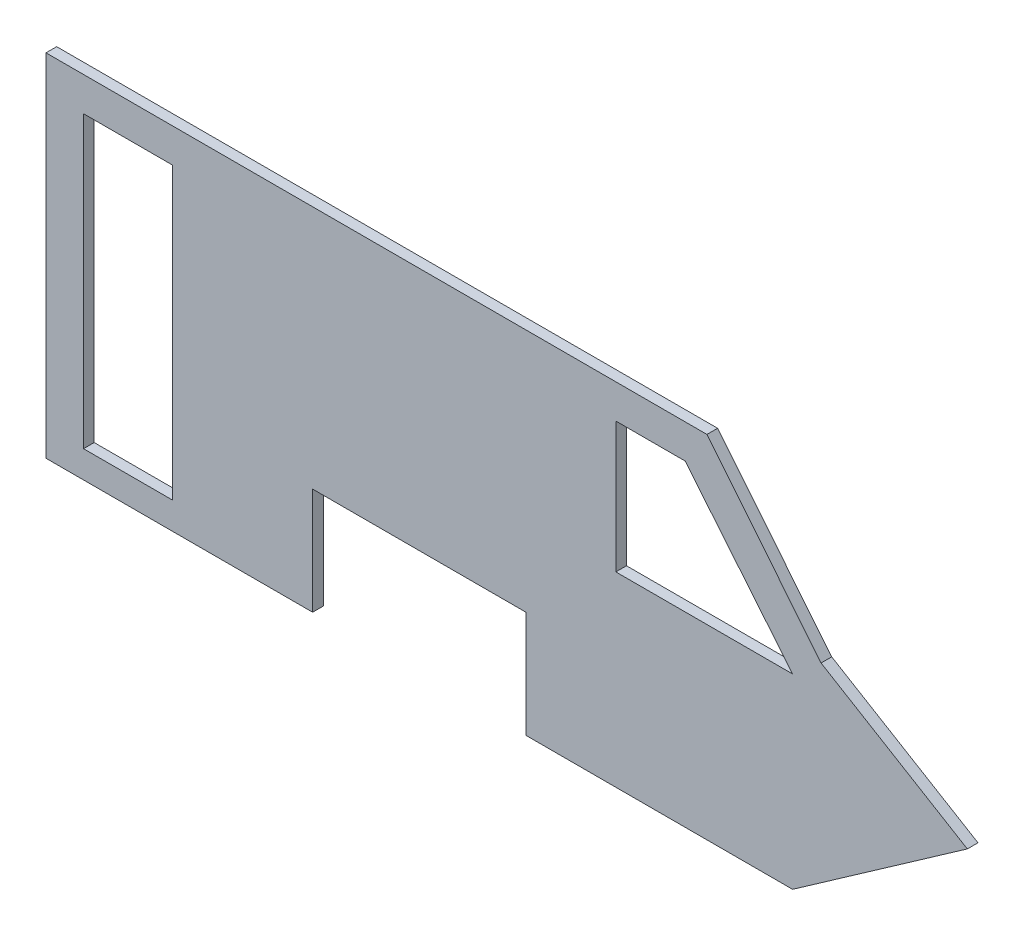
ISO-10303-21;
HEADER;
FILE_DESCRIPTION(('STEP AP214'),'2;1');
FILE_NAME('part.step','',(''),(''),'','','');
FILE_SCHEMA(('AUTOMOTIVE_DESIGN { 1 0 10303 214 1 1 1 1 }'));
ENDSEC;
DATA;
#1=APPLICATION_CONTEXT('core data for automotive mechanical design processes');
#2=APPLICATION_PROTOCOL_DEFINITION('international standard','automotive_design',2000,#1);
#3=PRODUCT_CONTEXT('',#1,'mechanical');
#4=PRODUCT('Part','Part','',(#3));
#5=PRODUCT_RELATED_PRODUCT_CATEGORY('part','',(#4));
#6=PRODUCT_DEFINITION_FORMATION('','',#4);
#7=PRODUCT_DEFINITION_CONTEXT('part definition',#1,'design');
#8=PRODUCT_DEFINITION('design','',#6,#7);
#9=PRODUCT_DEFINITION_SHAPE('','',#8);
#10=(LENGTH_UNIT() NAMED_UNIT(*) SI_UNIT(.MILLI.,.METRE.));
#11=(NAMED_UNIT(*) PLANE_ANGLE_UNIT() SI_UNIT($,.RADIAN.));
#12=(NAMED_UNIT(*) SI_UNIT($,.STERADIAN.) SOLID_ANGLE_UNIT());
#13=UNCERTAINTY_MEASURE_WITH_UNIT(LENGTH_MEASURE(1.E-05),#10,'distance_accuracy_value','');
#14=(GEOMETRIC_REPRESENTATION_CONTEXT(3) GLOBAL_UNCERTAINTY_ASSIGNED_CONTEXT((#13)) GLOBAL_UNIT_ASSIGNED_CONTEXT((#10,
#11,#12)) REPRESENTATION_CONTEXT('',''));
#15=CARTESIAN_POINT('',(0.,0.,0.));
#16=DIRECTION('',(0.,0.,1.));
#17=DIRECTION('',(1.,0.,0.));
#18=AXIS2_PLACEMENT_3D('',#15,#16,#17);
#19=CARTESIAN_POINT('',(0.,65.8472385407004,-2.));
#20=DIRECTION('',(-1.,0.,0.));
#21=DIRECTION('',(0.,-1.,0.));
#22=AXIS2_PLACEMENT_3D('',#19,#20,#21);
#23=PLANE('',#22);
#24=DIRECTION('',(0.,-1.,0.));
#25=VECTOR('',#24,1.);
#26=CARTESIAN_POINT('',(0.,65.8472385407004,0.));
#27=LINE('',#26,#25);
#28=CARTESIAN_POINT('',(0.,65.8472385407004,0.));
#29=VERTEX_POINT('',#28);
#30=CARTESIAN_POINT('',(0.,0.,0.));
#31=VERTEX_POINT('',#30);
#32=EDGE_CURVE('E222',#29,#31,#27,.T.);
#33=ORIENTED_EDGE('',*,*,#32,.F.);
#34=DIRECTION('',(0.,0.,1.));
#35=VECTOR('',#34,1.);
#36=CARTESIAN_POINT('',(0.,65.8472385407004,-2.));
#37=LINE('',#36,#35);
#38=CARTESIAN_POINT('',(0.,65.8472385407004,-2.));
#39=VERTEX_POINT('',#38);
#40=EDGE_CURVE('E11',#39,#29,#37,.T.);
#41=ORIENTED_EDGE('',*,*,#40,.F.);
#42=DIRECTION('',(0.,-1.,0.));
#43=VECTOR('',#42,1.);
#44=CARTESIAN_POINT('',(0.,65.8472385407004,-2.));
#45=LINE('',#44,#43);
#46=CARTESIAN_POINT('',(0.,0.,-2.));
#47=VERTEX_POINT('',#46);
#48=EDGE_CURVE('E229',#39,#47,#45,.T.);
#49=ORIENTED_EDGE('',*,*,#48,.T.);
#50=DIRECTION('',(0.,0.,1.));
#51=VECTOR('',#50,1.);
#52=CARTESIAN_POINT('',(0.,0.,-2.));
#53=LINE('',#52,#51);
#54=EDGE_CURVE('E38',#47,#31,#53,.T.);
#55=ORIENTED_EDGE('',*,*,#54,.T.);
#56=EDGE_LOOP('',(#33,#41,#49,#55));
#57=FACE_BOUND('',#56,.T.);
#58=ADVANCED_FACE('F35',(#57),#23,.T.);
#59=CARTESIAN_POINT('',(123.939834853397,65.8472385407004,-2.));
#60=DIRECTION('',(0.,1.,0.));
#61=DIRECTION('',(0.,0.,1.));
#62=AXIS2_PLACEMENT_3D('',#59,#60,#61);
#63=PLANE('',#62);
#64=DIRECTION('',(-1.,0.,0.));
#65=VECTOR('',#64,1.);
#66=CARTESIAN_POINT('',(123.939834853397,65.8472385407004,0.));
#67=LINE('',#66,#65);
#68=CARTESIAN_POINT('',(123.939834853397,65.8472385407004,0.));
#69=VERTEX_POINT('',#68);
#70=EDGE_CURVE('E233',#69,#29,#67,.T.);
#71=ORIENTED_EDGE('',*,*,#70,.F.);
#72=DIRECTION('',(0.,0.,1.));
#73=VECTOR('',#72,1.);
#74=CARTESIAN_POINT('',(123.939834853397,65.8472385407004,-2.));
#75=LINE('',#74,#73);
#76=CARTESIAN_POINT('',(123.939834853397,65.8472385407004,-2.));
#77=VERTEX_POINT('',#76);
#78=EDGE_CURVE('E43',#77,#69,#75,.T.);
#79=ORIENTED_EDGE('',*,*,#78,.F.);
#80=DIRECTION('',(-1.,0.,0.));
#81=VECTOR('',#80,1.);
#82=CARTESIAN_POINT('',(123.939834853397,65.8472385407004,-2.));
#83=LINE('',#82,#81);
#84=EDGE_CURVE('E257',#77,#39,#83,.T.);
#85=ORIENTED_EDGE('',*,*,#84,.T.);
#86=ORIENTED_EDGE('',*,*,#40,.T.);
#87=EDGE_LOOP('',(#71,#79,#85,#86));
#88=FACE_BOUND('',#87,.T.);
#89=ADVANCED_FACE('F314',(#88),#63,.T.);
#90=CARTESIAN_POINT('',(145.336728149092,39.4242758511635,-2.));
#91=DIRECTION('',(0.777145961456968,0.629320391049841,0.));
#92=DIRECTION('',(-0.629320391049841,0.777145961456968,0.));
#93=AXIS2_PLACEMENT_3D('',#90,#91,#92);
#94=PLANE('',#93);
#95=DIRECTION('',(-0.629320391049841,0.777145961456968,0.));
#96=VECTOR('',#95,1.);
#97=CARTESIAN_POINT('',(145.336728149092,39.4242758511635,0.));
#98=LINE('',#97,#96);
#99=CARTESIAN_POINT('',(145.336728149092,39.4242758511635,0.));
#100=VERTEX_POINT('',#99);
#101=EDGE_CURVE('E283',#100,#69,#98,.T.);
#102=ORIENTED_EDGE('',*,*,#101,.F.);
#103=DIRECTION('',(0.,0.,1.));
#104=VECTOR('',#103,1.);
#105=CARTESIAN_POINT('',(145.336728149092,39.4242758511635,-2.));
#106=LINE('',#105,#104);
#107=CARTESIAN_POINT('',(145.336728149092,39.4242758511635,-2.));
#108=VERTEX_POINT('',#107);
#109=EDGE_CURVE('E289',#108,#100,#106,.T.);
#110=ORIENTED_EDGE('',*,*,#109,.F.);
#111=DIRECTION('',(-0.629320391049841,0.777145961456968,0.));
#112=VECTOR('',#111,1.);
#113=CARTESIAN_POINT('',(145.336728149092,39.4242758511635,-2.));
#114=LINE('',#113,#112);
#115=EDGE_CURVE('E254',#108,#77,#114,.T.);
#116=ORIENTED_EDGE('',*,*,#115,.T.);
#117=ORIENTED_EDGE('',*,*,#78,.T.);
#118=EDGE_LOOP('',(#102,#110,#116,#117));
#119=FACE_BOUND('',#118,.T.);
#120=ADVANCED_FACE('F342',(#119),#94,.T.);
#121=CARTESIAN_POINT('',(172.76608177156,22.9430574540419,-2.));
#122=DIRECTION('',(0.515038074910049,0.857167300702115,0.));
#123=DIRECTION('',(-0.857167300702115,0.515038074910049,0.));
#124=AXIS2_PLACEMENT_3D('',#121,#122,#123);
#125=PLANE('',#124);
#126=DIRECTION('',(-0.857167300702116,0.515038074910049,0.));
#127=VECTOR('',#126,1.);
#128=CARTESIAN_POINT('',(172.76608177156,22.9430574540419,0.));
#129=LINE('',#128,#127);
#130=CARTESIAN_POINT('',(172.76608177156,22.9430574540419,0.));
#131=VERTEX_POINT('',#130);
#132=EDGE_CURVE('E280',#131,#100,#129,.T.);
#133=ORIENTED_EDGE('',*,*,#132,.F.);
#134=DIRECTION('',(0.,0.,1.));
#135=VECTOR('',#134,1.);
#136=CARTESIAN_POINT('',(172.76608177156,22.9430574540419,-2.));
#137=LINE('',#136,#135);
#138=CARTESIAN_POINT('',(172.76608177156,22.9430574540419,-2.));
#139=VERTEX_POINT('',#138);
#140=EDGE_CURVE('E291',#139,#131,#137,.T.);
#141=ORIENTED_EDGE('',*,*,#140,.F.);
#142=DIRECTION('',(-0.857167300702116,0.515038074910049,0.));
#143=VECTOR('',#142,1.);
#144=CARTESIAN_POINT('',(172.76608177156,22.9430574540419,-2.));
#145=LINE('',#144,#143);
#146=EDGE_CURVE('E251',#139,#108,#145,.T.);
#147=ORIENTED_EDGE('',*,*,#146,.T.);
#148=ORIENTED_EDGE('',*,*,#109,.T.);
#149=EDGE_LOOP('',(#133,#141,#147,#148));
#150=FACE_BOUND('',#149,.T.);
#151=ADVANCED_FACE('F340',(#150),#125,.T.);
#152=CARTESIAN_POINT('',(140.,0.,-2.));
#153=DIRECTION('',(0.573576436351047,-0.819152044288991,0.));
#154=DIRECTION('',(0.819152044288991,0.573576436351047,0.));
#155=AXIS2_PLACEMENT_3D('',#152,#153,#154);
#156=PLANE('',#155);
#157=DIRECTION('',(0.819152044288991,0.573576436351047,0.));
#158=VECTOR('',#157,1.);
#159=CARTESIAN_POINT('',(140.,0.,0.));
#160=LINE('',#159,#158);
#161=CARTESIAN_POINT('',(140.,0.,0.));
#162=VERTEX_POINT('',#161);
#163=EDGE_CURVE('E277',#162,#131,#160,.T.);
#164=ORIENTED_EDGE('',*,*,#163,.F.);
#165=DIRECTION('',(0.,0.,1.));
#166=VECTOR('',#165,1.);
#167=CARTESIAN_POINT('',(140.,0.,-2.));
#168=LINE('',#167,#166);
#169=CARTESIAN_POINT('',(140.,0.,-2.));
#170=VERTEX_POINT('',#169);
#171=EDGE_CURVE('E293',#170,#162,#168,.T.);
#172=ORIENTED_EDGE('',*,*,#171,.F.);
#173=DIRECTION('',(0.819152044288991,0.573576436351047,0.));
#174=VECTOR('',#173,1.);
#175=CARTESIAN_POINT('',(140.,0.,-2.));
#176=LINE('',#175,#174);
#177=EDGE_CURVE('E248',#170,#139,#176,.T.);
#178=ORIENTED_EDGE('',*,*,#177,.T.);
#179=ORIENTED_EDGE('',*,*,#140,.T.);
#180=EDGE_LOOP('',(#164,#172,#178,#179));
#181=FACE_BOUND('',#180,.T.);
#182=ADVANCED_FACE('F336',(#181),#156,.T.);
#183=CARTESIAN_POINT('',(90.,0.,-2.));
#184=DIRECTION('',(0.,-1.,0.));
#185=DIRECTION('',(0.,0.,-1.));
#186=AXIS2_PLACEMENT_3D('',#183,#184,#185);
#187=PLANE('',#186);
#188=DIRECTION('',(1.,0.,0.));
#189=VECTOR('',#188,1.);
#190=CARTESIAN_POINT('',(90.,0.,0.));
#191=LINE('',#190,#189);
#192=CARTESIAN_POINT('',(90.,0.,0.));
#193=VERTEX_POINT('',#192);
#194=EDGE_CURVE('E274',#193,#162,#191,.T.);
#195=ORIENTED_EDGE('',*,*,#194,.F.);
#196=DIRECTION('',(0.,0.,1.));
#197=VECTOR('',#196,1.);
#198=CARTESIAN_POINT('',(90.,0.,-2.));
#199=LINE('',#198,#197);
#200=CARTESIAN_POINT('',(90.,0.,-2.));
#201=VERTEX_POINT('',#200);
#202=EDGE_CURVE('E295',#201,#193,#199,.T.);
#203=ORIENTED_EDGE('',*,*,#202,.F.);
#204=DIRECTION('',(1.,0.,0.));
#205=VECTOR('',#204,1.);
#206=CARTESIAN_POINT('',(90.,0.,-2.));
#207=LINE('',#206,#205);
#208=EDGE_CURVE('E245',#201,#170,#207,.T.);
#209=ORIENTED_EDGE('',*,*,#208,.T.);
#210=ORIENTED_EDGE('',*,*,#171,.T.);
#211=EDGE_LOOP('',(#195,#203,#209,#210));
#212=FACE_BOUND('',#211,.T.);
#213=ADVANCED_FACE('F332',(#212),#187,.T.);
#214=CARTESIAN_POINT('',(90.,20.,-2.));
#215=DIRECTION('',(-1.,0.,0.));
#216=DIRECTION('',(0.,0.,1.));
#217=AXIS2_PLACEMENT_3D('',#214,#215,#216);
#218=PLANE('',#217);
#219=DIRECTION('',(0.,-1.,0.));
#220=VECTOR('',#219,1.);
#221=CARTESIAN_POINT('',(90.,20.,0.));
#222=LINE('',#221,#220);
#223=CARTESIAN_POINT('',(90.,20.,0.));
#224=VERTEX_POINT('',#223);
#225=EDGE_CURVE('E271',#224,#193,#222,.T.);
#226=ORIENTED_EDGE('',*,*,#225,.F.);
#227=DIRECTION('',(0.,0.,1.));
#228=VECTOR('',#227,1.);
#229=CARTESIAN_POINT('',(90.,20.,-2.));
#230=LINE('',#229,#228);
#231=CARTESIAN_POINT('',(90.,20.,-2.));
#232=VERTEX_POINT('',#231);
#233=EDGE_CURVE('E297',#232,#224,#230,.T.);
#234=ORIENTED_EDGE('',*,*,#233,.F.);
#235=DIRECTION('',(0.,-1.,0.));
#236=VECTOR('',#235,1.);
#237=CARTESIAN_POINT('',(90.,20.,-2.));
#238=LINE('',#237,#236);
#239=EDGE_CURVE('E242',#232,#201,#238,.T.);
#240=ORIENTED_EDGE('',*,*,#239,.T.);
#241=ORIENTED_EDGE('',*,*,#202,.T.);
#242=EDGE_LOOP('',(#226,#234,#240,#241));
#243=FACE_BOUND('',#242,.T.);
#244=ADVANCED_FACE('F328',(#243),#218,.T.);
#245=CARTESIAN_POINT('',(50.,20.,-2.));
#246=DIRECTION('',(0.,-1.,0.));
#247=DIRECTION('',(0.,0.,-1.));
#248=AXIS2_PLACEMENT_3D('',#245,#246,#247);
#249=PLANE('',#248);
#250=DIRECTION('',(1.,0.,0.));
#251=VECTOR('',#250,1.);
#252=CARTESIAN_POINT('',(50.,20.,0.));
#253=LINE('',#252,#251);
#254=CARTESIAN_POINT('',(50.,20.,0.));
#255=VERTEX_POINT('',#254);
#256=EDGE_CURVE('E268',#255,#224,#253,.T.);
#257=ORIENTED_EDGE('',*,*,#256,.F.);
#258=DIRECTION('',(0.,0.,1.));
#259=VECTOR('',#258,1.);
#260=CARTESIAN_POINT('',(50.,20.,-2.));
#261=LINE('',#260,#259);
#262=CARTESIAN_POINT('',(50.,20.,-2.));
#263=VERTEX_POINT('',#262);
#264=EDGE_CURVE('E299',#263,#255,#261,.T.);
#265=ORIENTED_EDGE('',*,*,#264,.F.);
#266=DIRECTION('',(1.,0.,0.));
#267=VECTOR('',#266,1.);
#268=CARTESIAN_POINT('',(50.,20.,-2.));
#269=LINE('',#268,#267);
#270=EDGE_CURVE('E239',#263,#232,#269,.T.);
#271=ORIENTED_EDGE('',*,*,#270,.T.);
#272=ORIENTED_EDGE('',*,*,#233,.T.);
#273=EDGE_LOOP('',(#257,#265,#271,#272));
#274=FACE_BOUND('',#273,.T.);
#275=ADVANCED_FACE('F326',(#274),#249,.T.);
#276=CARTESIAN_POINT('',(50.,0.,-2.));
#277=DIRECTION('',(1.,0.,0.));
#278=DIRECTION('',(0.,0.,-1.));
#279=AXIS2_PLACEMENT_3D('',#276,#277,#278);
#280=PLANE('',#279);
#281=DIRECTION('',(0.,1.,0.));
#282=VECTOR('',#281,1.);
#283=CARTESIAN_POINT('',(50.,0.,0.));
#284=LINE('',#283,#282);
#285=CARTESIAN_POINT('',(50.,0.,0.));
#286=VERTEX_POINT('',#285);
#287=EDGE_CURVE('E265',#286,#255,#284,.T.);
#288=ORIENTED_EDGE('',*,*,#287,.F.);
#289=DIRECTION('',(0.,0.,1.));
#290=VECTOR('',#289,1.);
#291=CARTESIAN_POINT('',(50.,0.,-2.));
#292=LINE('',#291,#290);
#293=CARTESIAN_POINT('',(50.,0.,-2.));
#294=VERTEX_POINT('',#293);
#295=EDGE_CURVE('E300',#294,#286,#292,.T.);
#296=ORIENTED_EDGE('',*,*,#295,.F.);
#297=DIRECTION('',(0.,1.,0.));
#298=VECTOR('',#297,1.);
#299=CARTESIAN_POINT('',(50.,0.,-2.));
#300=LINE('',#299,#298);
#301=EDGE_CURVE('E236',#294,#263,#300,.T.);
#302=ORIENTED_EDGE('',*,*,#301,.T.);
#303=ORIENTED_EDGE('',*,*,#264,.T.);
#304=EDGE_LOOP('',(#288,#296,#302,#303));
#305=FACE_BOUND('',#304,.T.);
#306=ADVANCED_FACE('F322',(#305),#280,.T.);
#307=CARTESIAN_POINT('',(0.,0.,-2.));
#308=DIRECTION('',(0.,-1.,0.));
#309=DIRECTION('',(0.,0.,-1.));
#310=AXIS2_PLACEMENT_3D('',#307,#308,#309);
#311=PLANE('',#310);
#312=DIRECTION('',(1.,0.,0.));
#313=VECTOR('',#312,1.);
#314=CARTESIAN_POINT('',(0.,0.,0.));
#315=LINE('',#314,#313);
#316=EDGE_CURVE('E262',#31,#286,#315,.T.);
#317=ORIENTED_EDGE('',*,*,#316,.F.);
#318=ORIENTED_EDGE('',*,*,#54,.F.);
#319=DIRECTION('',(1.,0.,0.));
#320=VECTOR('',#319,1.);
#321=CARTESIAN_POINT('',(0.,0.,-2.));
#322=LINE('',#321,#320);
#323=EDGE_CURVE('E232',#47,#294,#322,.T.);
#324=ORIENTED_EDGE('',*,*,#323,.T.);
#325=ORIENTED_EDGE('',*,*,#295,.T.);
#326=EDGE_LOOP('',(#317,#318,#324,#325));
#327=FACE_BOUND('',#326,.T.);
#328=ADVANCED_FACE('F308',(#327),#311,.T.);
#329=CARTESIAN_POINT('',(0.,0.,-2.));
#330=DIRECTION('',(0.,0.,1.));
#331=DIRECTION('',(1.,0.,0.));
#332=AXIS2_PLACEMENT_3D('',#329,#330,#331);
#333=PLANE('',#332);
#334=DIRECTION('',(-1.,0.,0.));
#335=VECTOR('',#334,1.);
#336=CARTESIAN_POINT('',(7.03482370152497,59.4771792162685,-2.));
#337=LINE('',#336,#335);
#338=CARTESIAN_POINT('',(23.7283828898666,59.4771792162685,-2.));
#339=VERTEX_POINT('',#338);
#340=CARTESIAN_POINT('',(7.03482370152497,59.4771792162685,-2.));
#341=VERTEX_POINT('',#340);
#342=EDGE_CURVE('E168',#339,#341,#337,.T.);
#343=ORIENTED_EDGE('',*,*,#342,.T.);
#344=DIRECTION('',(0.,-1.,0.));
#345=VECTOR('',#344,1.);
#346=CARTESIAN_POINT('',(7.03482370152497,5.07601108977412,-2.));
#347=LINE('',#346,#345);
#348=CARTESIAN_POINT('',(7.03482370152497,5.07601108977412,-2.));
#349=VERTEX_POINT('',#348);
#350=EDGE_CURVE('E162',#341,#349,#347,.T.);
#351=ORIENTED_EDGE('',*,*,#350,.T.);
#352=DIRECTION('',(1.,0.,0.));
#353=VECTOR('',#352,1.);
#354=CARTESIAN_POINT('',(23.7283828898666,5.07601108977412,-2.));
#355=LINE('',#354,#353);
#356=CARTESIAN_POINT('',(23.7283828898666,5.07601108977412,-2.));
#357=VERTEX_POINT('',#356);
#358=EDGE_CURVE('E171',#349,#357,#355,.T.);
#359=ORIENTED_EDGE('',*,*,#358,.T.);
#360=DIRECTION('',(0.,1.,0.));
#361=VECTOR('',#360,1.);
#362=CARTESIAN_POINT('',(23.7283828898666,59.4771792162685,-2.));
#363=LINE('',#362,#361);
#364=EDGE_CURVE('E51',#357,#339,#363,.T.);
#365=ORIENTED_EDGE('',*,*,#364,.T.);
#366=EDGE_LOOP('',(#343,#351,#359,#365));
#367=FACE_BOUND('',#366,.T.);
#368=DIRECTION('',(-0.635093678794668,0.772435122942409,0.));
#369=VECTOR('',#368,1.);
#370=CARTESIAN_POINT('',(119.854889561005,59.4771792162685,-2.));
#371=LINE('',#370,#369);
#372=CARTESIAN_POINT('',(140.,34.9756113717163,-2.));
#373=VERTEX_POINT('',#372);
#374=CARTESIAN_POINT('',(119.854889561005,59.4771792162685,-2.));
#375=VERTEX_POINT('',#374);
#376=EDGE_CURVE('E207',#373,#375,#371,.T.);
#377=ORIENTED_EDGE('',*,*,#376,.T.);
#378=DIRECTION('',(-1.,0.,0.));
#379=VECTOR('',#378,1.);
#380=CARTESIAN_POINT('',(106.853264521955,59.4771792162685,-2.));
#381=LINE('',#380,#379);
#382=CARTESIAN_POINT('',(106.853264521955,59.4771792162685,-2.));
#383=VERTEX_POINT('',#382);
#384=EDGE_CURVE('E197',#375,#383,#381,.T.);
#385=ORIENTED_EDGE('',*,*,#384,.T.);
#386=DIRECTION('',(0.,-1.,0.));
#387=VECTOR('',#386,1.);
#388=CARTESIAN_POINT('',(106.853264521955,34.9756113717163,-2.));
#389=LINE('',#388,#387);
#390=CARTESIAN_POINT('',(106.853264521955,34.9756113717163,-2.));
#391=VERTEX_POINT('',#390);
#392=EDGE_CURVE('E200',#383,#391,#389,.T.);
#393=ORIENTED_EDGE('',*,*,#392,.T.);
#394=DIRECTION('',(1.,0.,0.));
#395=VECTOR('',#394,1.);
#396=CARTESIAN_POINT('',(140.,34.9756113717163,-2.));
#397=LINE('',#396,#395);
#398=EDGE_CURVE('E204',#391,#373,#397,.T.);
#399=ORIENTED_EDGE('',*,*,#398,.T.);
#400=EDGE_LOOP('',(#377,#385,#393,#399));
#401=FACE_BOUND('',#400,.T.);
#402=ORIENTED_EDGE('',*,*,#48,.F.);
#403=ORIENTED_EDGE('',*,*,#84,.F.);
#404=ORIENTED_EDGE('',*,*,#115,.F.);
#405=ORIENTED_EDGE('',*,*,#146,.F.);
#406=ORIENTED_EDGE('',*,*,#177,.F.);
#407=ORIENTED_EDGE('',*,*,#208,.F.);
#408=ORIENTED_EDGE('',*,*,#239,.F.);
#409=ORIENTED_EDGE('',*,*,#270,.F.);
#410=ORIENTED_EDGE('',*,*,#301,.F.);
#411=ORIENTED_EDGE('',*,*,#323,.F.);
#412=EDGE_LOOP('',(#402,#403,#404,#405,#406,#407,#408,#409,#410,#411));
#413=FACE_BOUND('',#412,.T.);
#414=ADVANCED_FACE('F175',(#367,#401,#413),#333,.F.);
#415=CARTESIAN_POINT('',(0.,0.,0.));
#416=DIRECTION('',(0.,0.,1.));
#417=DIRECTION('',(1.,0.,0.));
#418=AXIS2_PLACEMENT_3D('',#415,#416,#417);
#419=PLANE('',#418);
#420=DIRECTION('',(0.,-1.,0.));
#421=VECTOR('',#420,1.);
#422=CARTESIAN_POINT('',(7.03482370152497,5.07601108977412,0.));
#423=LINE('',#422,#421);
#424=CARTESIAN_POINT('',(7.03482370152497,59.4771792162685,0.));
#425=VERTEX_POINT('',#424);
#426=CARTESIAN_POINT('',(7.03482370152497,5.07601108977412,0.));
#427=VERTEX_POINT('',#426);
#428=EDGE_CURVE('E59',#425,#427,#423,.T.);
#429=ORIENTED_EDGE('',*,*,#428,.F.);
#430=DIRECTION('',(-1.,0.,0.));
#431=VECTOR('',#430,1.);
#432=CARTESIAN_POINT('',(7.03482370152497,59.4771792162685,0.));
#433=LINE('',#432,#431);
#434=CARTESIAN_POINT('',(23.7283828898666,59.4771792162685,0.));
#435=VERTEX_POINT('',#434);
#436=EDGE_CURVE('E178',#435,#425,#433,.T.);
#437=ORIENTED_EDGE('',*,*,#436,.F.);
#438=DIRECTION('',(0.,1.,0.));
#439=VECTOR('',#438,1.);
#440=CARTESIAN_POINT('',(23.7283828898666,59.4771792162685,0.));
#441=LINE('',#440,#439);
#442=CARTESIAN_POINT('',(23.7283828898666,5.07601108977412,0.));
#443=VERTEX_POINT('',#442);
#444=EDGE_CURVE('E181',#443,#435,#441,.T.);
#445=ORIENTED_EDGE('',*,*,#444,.F.);
#446=DIRECTION('',(1.,0.,0.));
#447=VECTOR('',#446,1.);
#448=CARTESIAN_POINT('',(23.7283828898666,5.07601108977412,0.));
#449=LINE('',#448,#447);
#450=EDGE_CURVE('E187',#427,#443,#449,.T.);
#451=ORIENTED_EDGE('',*,*,#450,.F.);
#452=EDGE_LOOP('',(#429,#437,#445,#451));
#453=FACE_BOUND('',#452,.T.);
#454=DIRECTION('',(-1.,0.,0.));
#455=VECTOR('',#454,1.);
#456=CARTESIAN_POINT('',(106.853264521955,59.4771792162685,0.));
#457=LINE('',#456,#455);
#458=CARTESIAN_POINT('',(119.854889561005,59.4771792162685,0.));
#459=VERTEX_POINT('',#458);
#460=CARTESIAN_POINT('',(106.853264521955,59.4771792162685,0.));
#461=VERTEX_POINT('',#460);
#462=EDGE_CURVE('E193',#459,#461,#457,.T.);
#463=ORIENTED_EDGE('',*,*,#462,.F.);
#464=DIRECTION('',(-0.635093678794668,0.772435122942409,0.));
#465=VECTOR('',#464,1.);
#466=CARTESIAN_POINT('',(119.854889561005,59.4771792162685,0.));
#467=LINE('',#466,#465);
#468=CARTESIAN_POINT('',(140.,34.9756113717163,0.));
#469=VERTEX_POINT('',#468);
#470=EDGE_CURVE('E201',#469,#459,#467,.T.);
#471=ORIENTED_EDGE('',*,*,#470,.F.);
#472=DIRECTION('',(1.,0.,0.));
#473=VECTOR('',#472,1.);
#474=CARTESIAN_POINT('',(140.,34.9756113717163,0.));
#475=LINE('',#474,#473);
#476=CARTESIAN_POINT('',(106.853264521955,34.9756113717163,0.));
#477=VERTEX_POINT('',#476);
#478=EDGE_CURVE('E215',#477,#469,#475,.T.);
#479=ORIENTED_EDGE('',*,*,#478,.F.);
#480=DIRECTION('',(0.,-1.,0.));
#481=VECTOR('',#480,1.);
#482=CARTESIAN_POINT('',(106.853264521955,34.9756113717163,0.));
#483=LINE('',#482,#481);
#484=EDGE_CURVE('E212',#461,#477,#483,.T.);
#485=ORIENTED_EDGE('',*,*,#484,.F.);
#486=EDGE_LOOP('',(#463,#471,#479,#485));
#487=FACE_BOUND('',#486,.T.);
#488=ORIENTED_EDGE('',*,*,#32,.T.);
#489=ORIENTED_EDGE('',*,*,#316,.T.);
#490=ORIENTED_EDGE('',*,*,#287,.T.);
#491=ORIENTED_EDGE('',*,*,#256,.T.);
#492=ORIENTED_EDGE('',*,*,#225,.T.);
#493=ORIENTED_EDGE('',*,*,#194,.T.);
#494=ORIENTED_EDGE('',*,*,#163,.T.);
#495=ORIENTED_EDGE('',*,*,#132,.T.);
#496=ORIENTED_EDGE('',*,*,#101,.T.);
#497=ORIENTED_EDGE('',*,*,#70,.T.);
#498=EDGE_LOOP('',(#488,#489,#490,#491,#492,#493,#494,#495,#496,#497));
#499=FACE_BOUND('',#498,.T.);
#500=ADVANCED_FACE('F310',(#453,#487,#499),#419,.T.);
#501=CARTESIAN_POINT('',(106.853264521955,59.4771792162685,-2.));
#502=DIRECTION('',(0.,1.,0.));
#503=DIRECTION('',(0.,0.,1.));
#504=AXIS2_PLACEMENT_3D('',#501,#502,#503);
#505=PLANE('',#504);
#506=ORIENTED_EDGE('',*,*,#462,.T.);
#507=DIRECTION('',(0.,0.,1.));
#508=VECTOR('',#507,1.);
#509=CARTESIAN_POINT('',(106.853264521955,59.4771792162685,-2.));
#510=LINE('',#509,#508);
#511=EDGE_CURVE('E210',#383,#461,#510,.T.);
#512=ORIENTED_EDGE('',*,*,#511,.F.);
#513=ORIENTED_EDGE('',*,*,#384,.F.);
#514=DIRECTION('',(0.,0.,1.));
#515=VECTOR('',#514,1.);
#516=CARTESIAN_POINT('',(119.854889561005,59.4771792162685,-2.));
#517=LINE('',#516,#515);
#518=EDGE_CURVE('E220',#375,#459,#517,.T.);
#519=ORIENTED_EDGE('',*,*,#518,.T.);
#520=EDGE_LOOP('',(#506,#512,#513,#519));
#521=FACE_BOUND('',#520,.T.);
#522=ADVANCED_FACE('F442',(#521),#505,.F.);
#523=CARTESIAN_POINT('',(119.854889561005,59.4771792162685,-2.));
#524=DIRECTION('',(0.772435122942409,0.635093678794669,0.));
#525=DIRECTION('',(-0.635093678794669,0.772435122942409,0.));
#526=AXIS2_PLACEMENT_3D('',#523,#524,#525);
#527=PLANE('',#526);
#528=ORIENTED_EDGE('',*,*,#470,.T.);
#529=ORIENTED_EDGE('',*,*,#518,.F.);
#530=ORIENTED_EDGE('',*,*,#376,.F.);
#531=DIRECTION('',(0.,0.,1.));
#532=VECTOR('',#531,1.);
#533=CARTESIAN_POINT('',(140.,34.9756113717163,-2.));
#534=LINE('',#533,#532);
#535=EDGE_CURVE('E223',#373,#469,#534,.T.);
#536=ORIENTED_EDGE('',*,*,#535,.T.);
#537=EDGE_LOOP('',(#528,#529,#530,#536));
#538=FACE_BOUND('',#537,.T.);
#539=ADVANCED_FACE('F453',(#538),#527,.F.);
#540=CARTESIAN_POINT('',(140.,34.9756113717163,-2.));
#541=DIRECTION('',(0.,-1.,0.));
#542=DIRECTION('',(0.,0.,-1.));
#543=AXIS2_PLACEMENT_3D('',#540,#541,#542);
#544=PLANE('',#543);
#545=ORIENTED_EDGE('',*,*,#478,.T.);
#546=ORIENTED_EDGE('',*,*,#535,.F.);
#547=ORIENTED_EDGE('',*,*,#398,.F.);
#548=DIRECTION('',(0.,0.,1.));
#549=VECTOR('',#548,1.);
#550=CARTESIAN_POINT('',(106.853264521955,34.9756113717163,-2.));
#551=LINE('',#550,#549);
#552=EDGE_CURVE('E225',#391,#477,#551,.T.);
#553=ORIENTED_EDGE('',*,*,#552,.T.);
#554=EDGE_LOOP('',(#545,#546,#547,#553));
#555=FACE_BOUND('',#554,.T.);
#556=ADVANCED_FACE('F464',(#555),#544,.F.);
#557=CARTESIAN_POINT('',(106.853264521955,34.9756113717163,-2.));
#558=DIRECTION('',(-1.,0.,0.));
#559=DIRECTION('',(0.,0.,1.));
#560=AXIS2_PLACEMENT_3D('',#557,#558,#559);
#561=PLANE('',#560);
#562=ORIENTED_EDGE('',*,*,#484,.T.);
#563=ORIENTED_EDGE('',*,*,#552,.F.);
#564=ORIENTED_EDGE('',*,*,#392,.F.);
#565=ORIENTED_EDGE('',*,*,#511,.T.);
#566=EDGE_LOOP('',(#562,#563,#564,#565));
#567=FACE_BOUND('',#566,.T.);
#568=ADVANCED_FACE('F475',(#567),#561,.F.);
#569=CARTESIAN_POINT('',(7.03482370152497,5.07601108977412,-2.));
#570=DIRECTION('',(-1.,0.,0.));
#571=DIRECTION('',(0.,0.,1.));
#572=AXIS2_PLACEMENT_3D('',#569,#570,#571);
#573=PLANE('',#572);
#574=ORIENTED_EDGE('',*,*,#428,.T.);
#575=DIRECTION('',(0.,0.,1.));
#576=VECTOR('',#575,1.);
#577=CARTESIAN_POINT('',(7.03482370152497,5.07601108977412,-2.));
#578=LINE('',#577,#576);
#579=EDGE_CURVE('E158',#349,#427,#578,.T.);
#580=ORIENTED_EDGE('',*,*,#579,.F.);
#581=ORIENTED_EDGE('',*,*,#350,.F.);
#582=DIRECTION('',(0.,0.,1.));
#583=VECTOR('',#582,1.);
#584=CARTESIAN_POINT('',(7.03482370152497,59.4771792162685,-2.));
#585=LINE('',#584,#583);
#586=EDGE_CURVE('E191',#341,#425,#585,.T.);
#587=ORIENTED_EDGE('',*,*,#586,.T.);
#588=EDGE_LOOP('',(#574,#580,#581,#587));
#589=FACE_BOUND('',#588,.T.);
#590=ADVANCED_FACE('F160',(#589),#573,.F.);
#591=CARTESIAN_POINT('',(7.03482370152497,59.4771792162685,-2.));
#592=DIRECTION('',(0.,1.,0.));
#593=DIRECTION('',(0.,0.,1.));
#594=AXIS2_PLACEMENT_3D('',#591,#592,#593);
#595=PLANE('',#594);
#596=ORIENTED_EDGE('',*,*,#436,.T.);
#597=ORIENTED_EDGE('',*,*,#586,.F.);
#598=ORIENTED_EDGE('',*,*,#342,.F.);
#599=DIRECTION('',(0.,0.,1.));
#600=VECTOR('',#599,1.);
#601=CARTESIAN_POINT('',(23.7283828898666,59.4771792162685,-2.));
#602=LINE('',#601,#600);
#603=EDGE_CURVE('E194',#339,#435,#602,.T.);
#604=ORIENTED_EDGE('',*,*,#603,.T.);
#605=EDGE_LOOP('',(#596,#597,#598,#604));
#606=FACE_BOUND('',#605,.T.);
#607=ADVANCED_FACE('F496',(#606),#595,.F.);
#608=CARTESIAN_POINT('',(23.7283828898666,59.4771792162685,-2.));
#609=DIRECTION('',(1.,0.,0.));
#610=DIRECTION('',(0.,0.,-1.));
#611=AXIS2_PLACEMENT_3D('',#608,#609,#610);
#612=PLANE('',#611);
#613=ORIENTED_EDGE('',*,*,#444,.T.);
#614=ORIENTED_EDGE('',*,*,#603,.F.);
#615=ORIENTED_EDGE('',*,*,#364,.F.);
#616=DIRECTION('',(0.,0.,1.));
#617=VECTOR('',#616,1.);
#618=CARTESIAN_POINT('',(23.7283828898666,5.07601108977412,-2.));
#619=LINE('',#618,#617);
#620=EDGE_CURVE('E167',#357,#443,#619,.T.);
#621=ORIENTED_EDGE('',*,*,#620,.T.);
#622=EDGE_LOOP('',(#613,#614,#615,#621));
#623=FACE_BOUND('',#622,.T.);
#624=ADVANCED_FACE('F506',(#623),#612,.F.);
#625=CARTESIAN_POINT('',(23.7283828898666,5.07601108977412,-2.));
#626=DIRECTION('',(0.,-1.,0.));
#627=DIRECTION('',(0.,0.,-1.));
#628=AXIS2_PLACEMENT_3D('',#625,#626,#627);
#629=PLANE('',#628);
#630=ORIENTED_EDGE('',*,*,#450,.T.);
#631=ORIENTED_EDGE('',*,*,#620,.F.);
#632=ORIENTED_EDGE('',*,*,#358,.F.);
#633=ORIENTED_EDGE('',*,*,#579,.T.);
#634=EDGE_LOOP('',(#630,#631,#632,#633));
#635=FACE_BOUND('',#634,.T.);
#636=ADVANCED_FACE('F172',(#635),#629,.F.);
#637=CLOSED_SHELL('',(#58,#89,#120,#151,#182,#213,#244,#275,#306,#328,#414,#500,#522,#539,#556,
#568,#590,#607,#624,#636));
#638=MANIFOLD_SOLID_BREP('B2',#637);
#639=ADVANCED_BREP_SHAPE_REPRESENTATION('',(#18,#638),#14);
#640=SHAPE_DEFINITION_REPRESENTATION(#9,#639);
ENDSEC;
END-ISO-10303-21;
